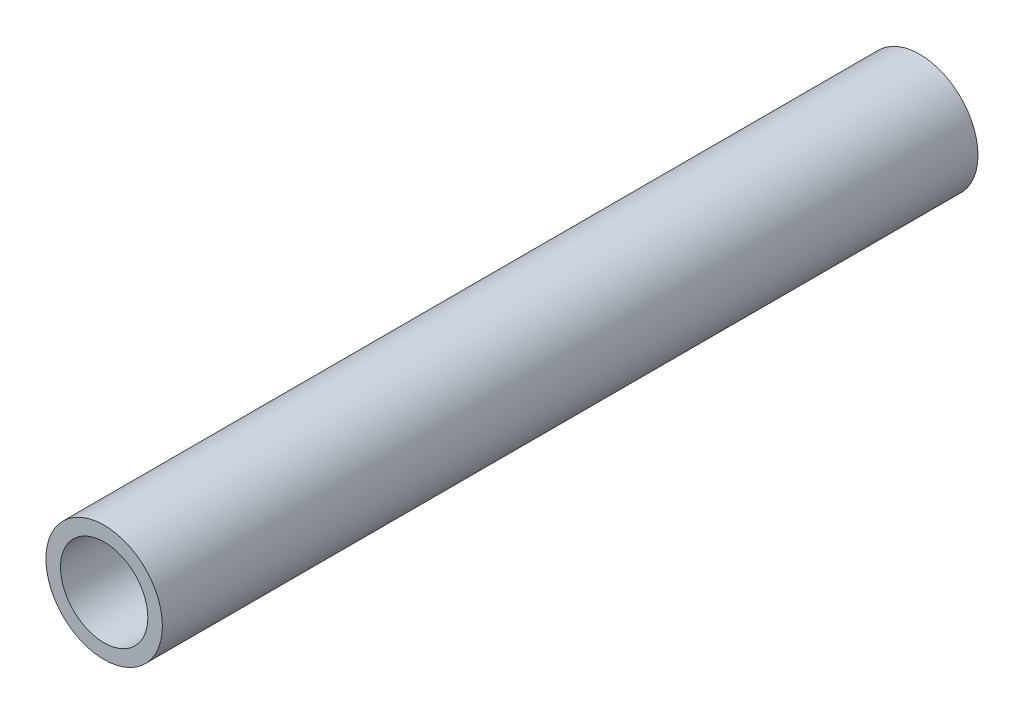
ISO-10303-21;
HEADER;
FILE_DESCRIPTION(('STEP AP214'),'2;1');
FILE_NAME('part.step','',(''),(''),'','','');
FILE_SCHEMA(('AUTOMOTIVE_DESIGN { 1 0 10303 214 1 1 1 1 }'));
ENDSEC;
DATA;
#1=APPLICATION_CONTEXT('core data for automotive mechanical design processes');
#2=APPLICATION_PROTOCOL_DEFINITION('international standard','automotive_design',2000,#1);
#3=PRODUCT_CONTEXT('',#1,'mechanical');
#4=PRODUCT('Part','Part','',(#3));
#5=PRODUCT_RELATED_PRODUCT_CATEGORY('part','',(#4));
#6=PRODUCT_DEFINITION_FORMATION('','',#4);
#7=PRODUCT_DEFINITION_CONTEXT('part definition',#1,'design');
#8=PRODUCT_DEFINITION('design','',#6,#7);
#9=PRODUCT_DEFINITION_SHAPE('','',#8);
#10=(LENGTH_UNIT() NAMED_UNIT(*) SI_UNIT(.MILLI.,.METRE.));
#11=(NAMED_UNIT(*) PLANE_ANGLE_UNIT() SI_UNIT($,.RADIAN.));
#12=(NAMED_UNIT(*) SI_UNIT($,.STERADIAN.) SOLID_ANGLE_UNIT());
#13=UNCERTAINTY_MEASURE_WITH_UNIT(LENGTH_MEASURE(1.E-05),#10,'distance_accuracy_value','');
#14=(GEOMETRIC_REPRESENTATION_CONTEXT(3) GLOBAL_UNCERTAINTY_ASSIGNED_CONTEXT((#13)) GLOBAL_UNIT_ASSIGNED_CONTEXT((#10,
#11,#12)) REPRESENTATION_CONTEXT('',''));
#15=CARTESIAN_POINT('',(0.,0.,0.));
#16=DIRECTION('',(0.,0.,1.));
#17=DIRECTION('',(1.,0.,0.));
#18=AXIS2_PLACEMENT_3D('',#15,#16,#17);
#19=CARTESIAN_POINT('',(0.,0.,177.8));
#20=DIRECTION('',(0.,0.,1.));
#21=DIRECTION('',(1.,0.,0.));
#22=AXIS2_PLACEMENT_3D('',#19,#20,#21);
#23=PLANE('',#22);
#24=CARTESIAN_POINT('',(0.,0.,177.8));
#25=DIRECTION('',(0.,0.,1.));
#26=DIRECTION('',(1.,0.,0.));
#27=AXIS2_PLACEMENT_3D('',#24,#25,#26);
#28=CIRCLE('',#27,12.7);
#29=CARTESIAN_POINT('',(12.7,0.,177.8));
#30=VERTEX_POINT('',#29);
#31=EDGE_CURVE('E10',#30,#30,#28,.T.);
#32=ORIENTED_EDGE('',*,*,#31,.T.);
#33=EDGE_LOOP('',(#32));
#34=FACE_BOUND('',#33,.T.);
#35=CARTESIAN_POINT('',(0.,0.,177.8));
#36=DIRECTION('',(0.,0.,1.));
#37=DIRECTION('',(1.,0.,0.));
#38=AXIS2_PLACEMENT_3D('',#35,#36,#37);
#39=CIRCLE('',#38,9.525);
#40=CARTESIAN_POINT('',(9.525,0.,177.8));
#41=VERTEX_POINT('',#40);
#42=EDGE_CURVE('E46',#41,#41,#39,.T.);
#43=ORIENTED_EDGE('',*,*,#42,.F.);
#44=EDGE_LOOP('',(#43));
#45=FACE_BOUND('',#44,.T.);
#46=ADVANCED_FACE('F35',(#34,#45),#23,.T.);
#47=CARTESIAN_POINT('',(0.,0.,0.));
#48=DIRECTION('',(0.,0.,1.));
#49=DIRECTION('',(1.,0.,0.));
#50=AXIS2_PLACEMENT_3D('',#47,#48,#49);
#51=PLANE('',#50);
#52=CARTESIAN_POINT('',(0.,0.,0.));
#53=DIRECTION('',(0.,0.,1.));
#54=DIRECTION('',(1.,0.,0.));
#55=AXIS2_PLACEMENT_3D('',#52,#53,#54);
#56=CIRCLE('',#55,12.7);
#57=CARTESIAN_POINT('',(12.7,0.,0.));
#58=VERTEX_POINT('',#57);
#59=EDGE_CURVE('E39',#58,#58,#56,.T.);
#60=ORIENTED_EDGE('',*,*,#59,.F.);
#61=EDGE_LOOP('',(#60));
#62=FACE_BOUND('',#61,.T.);
#63=CARTESIAN_POINT('',(0.,0.,0.));
#64=DIRECTION('',(0.,0.,1.));
#65=DIRECTION('',(1.,0.,0.));
#66=AXIS2_PLACEMENT_3D('',#63,#64,#65);
#67=CIRCLE('',#66,9.525);
#68=CARTESIAN_POINT('',(9.525,0.,0.));
#69=VERTEX_POINT('',#68);
#70=EDGE_CURVE('E48',#69,#69,#67,.T.);
#71=ORIENTED_EDGE('',*,*,#70,.T.);
#72=EDGE_LOOP('',(#71));
#73=FACE_BOUND('',#72,.T.);
#74=ADVANCED_FACE('F58',(#62,#73),#51,.F.);
#75=CARTESIAN_POINT('',(0.,0.,177.8));
#76=DIRECTION('',(0.,0.,-1.));
#77=DIRECTION('',(-1.,0.,0.));
#78=AXIS2_PLACEMENT_3D('',#75,#76,#77);
#79=CYLINDRICAL_SURFACE('',#78,12.7);
#80=ORIENTED_EDGE('',*,*,#31,.F.);
#81=EDGE_LOOP('',(#80));
#82=FACE_BOUND('',#81,.T.);
#83=ORIENTED_EDGE('',*,*,#59,.T.);
#84=EDGE_LOOP('',(#83));
#85=FACE_BOUND('',#84,.T.);
#86=ADVANCED_FACE('F37',(#82,#85),#79,.T.);
#87=CARTESIAN_POINT('',(0.,0.,177.8));
#88=DIRECTION('',(0.,0.,-1.));
#89=DIRECTION('',(-1.,0.,0.));
#90=AXIS2_PLACEMENT_3D('',#87,#88,#89);
#91=CYLINDRICAL_SURFACE('',#90,9.525);
#92=ORIENTED_EDGE('',*,*,#42,.T.);
#93=EDGE_LOOP('',(#92));
#94=FACE_BOUND('',#93,.T.);
#95=ORIENTED_EDGE('',*,*,#70,.F.);
#96=EDGE_LOOP('',(#95));
#97=FACE_BOUND('',#96,.T.);
#98=ADVANCED_FACE('F54',(#94,#97),#91,.F.);
#99=CLOSED_SHELL('',(#46,#74,#86,#98));
#100=MANIFOLD_SOLID_BREP('B2',#99);
#101=ADVANCED_BREP_SHAPE_REPRESENTATION('',(#18,#100),#14);
#102=SHAPE_DEFINITION_REPRESENTATION(#9,#101);
ENDSEC;
END-ISO-10303-21;
